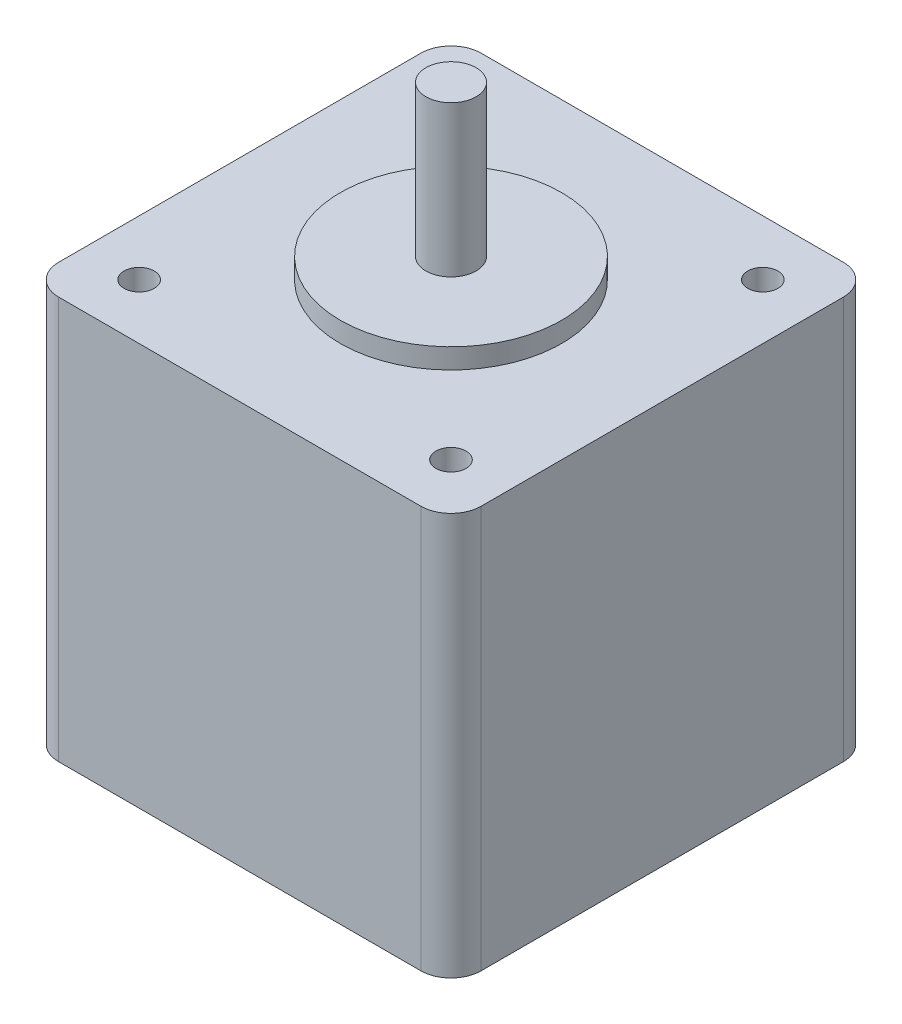
ISO-10303-21;
HEADER;
FILE_DESCRIPTION(('STEP AP214'),'2;1');
FILE_NAME('part.step','',(''),(''),'','','');
FILE_SCHEMA(('AUTOMOTIVE_DESIGN { 1 0 10303 214 1 1 1 1 }'));
ENDSEC;
DATA;
#1=APPLICATION_CONTEXT('core data for automotive mechanical design processes');
#2=APPLICATION_PROTOCOL_DEFINITION('international standard','automotive_design',2000,#1);
#3=PRODUCT_CONTEXT('',#1,'mechanical');
#4=PRODUCT('Part','Part','',(#3));
#5=PRODUCT_RELATED_PRODUCT_CATEGORY('part','',(#4));
#6=PRODUCT_DEFINITION_FORMATION('','',#4);
#7=PRODUCT_DEFINITION_CONTEXT('part definition',#1,'design');
#8=PRODUCT_DEFINITION('design','',#6,#7);
#9=PRODUCT_DEFINITION_SHAPE('','',#8);
#10=(LENGTH_UNIT() NAMED_UNIT(*) SI_UNIT(.MILLI.,.METRE.));
#11=(NAMED_UNIT(*) PLANE_ANGLE_UNIT() SI_UNIT($,.RADIAN.));
#12=(NAMED_UNIT(*) SI_UNIT($,.STERADIAN.) SOLID_ANGLE_UNIT());
#13=UNCERTAINTY_MEASURE_WITH_UNIT(LENGTH_MEASURE(1.E-05),#10,'distance_accuracy_value','');
#14=(GEOMETRIC_REPRESENTATION_CONTEXT(3) GLOBAL_UNCERTAINTY_ASSIGNED_CONTEXT((#13)) GLOBAL_UNIT_ASSIGNED_CONTEXT((#10,
#11,#12)) REPRESENTATION_CONTEXT('',''));
#15=CARTESIAN_POINT('',(0.,0.,0.));
#16=DIRECTION('',(0.,0.,1.));
#17=DIRECTION('',(1.,0.,0.));
#18=AXIS2_PLACEMENT_3D('',#15,#16,#17);
#19=CARTESIAN_POINT('',(21.,42.,-21.));
#20=DIRECTION('',(0.,1.,0.));
#21=DIRECTION('',(0.,0.,1.));
#22=AXIS2_PLACEMENT_3D('',#19,#20,#21);
#23=PLANE('',#22);
#24=CARTESIAN_POINT('',(21.,42.,-21.));
#25=DIRECTION('',(0.,1.,0.));
#26=DIRECTION('',(0.,0.,1.));
#27=AXIS2_PLACEMENT_3D('',#24,#25,#26);
#28=CIRCLE('',#27,11.);
#29=CARTESIAN_POINT('',(21.,42.,-9.99999999999999));
#30=VERTEX_POINT('',#29);
#31=EDGE_CURVE('E136',#30,#30,#28,.T.);
#32=ORIENTED_EDGE('',*,*,#31,.T.);
#33=EDGE_LOOP('',(#32));
#34=FACE_BOUND('',#33,.T.);
#35=CARTESIAN_POINT('',(21.,42.,-21.));
#36=DIRECTION('',(0.,1.,0.));
#37=DIRECTION('',(0.,0.,1.));
#38=AXIS2_PLACEMENT_3D('',#35,#36,#37);
#39=CIRCLE('',#38,2.5);
#40=CARTESIAN_POINT('',(21.,42.,-18.5));
#41=VERTEX_POINT('',#40);
#42=EDGE_CURVE('E187',#41,#41,#39,.T.);
#43=ORIENTED_EDGE('',*,*,#42,.F.);
#44=EDGE_LOOP('',(#43));
#45=FACE_BOUND('',#44,.T.);
#46=ADVANCED_FACE('F33',(#34,#45),#23,.T.);
#47=CARTESIAN_POINT('',(39.,40.,-39.));
#48=DIRECTION('',(0.,-1.,0.));
#49=DIRECTION('',(0.,0.,-1.));
#50=AXIS2_PLACEMENT_3D('',#47,#48,#49);
#51=PLANE('',#50);
#52=CARTESIAN_POINT('',(5.50000000000032,40.,-5.49999999999999));
#53=DIRECTION('',(0.,1.,0.));
#54=DIRECTION('',(0.,0.,1.));
#55=AXIS2_PLACEMENT_3D('',#52,#53,#54);
#56=CIRCLE('',#55,1.5);
#57=CARTESIAN_POINT('',(5.50000000000032,40.,-3.99999999999999));
#58=VERTEX_POINT('',#57);
#59=EDGE_CURVE('E211',#58,#58,#56,.T.);
#60=ORIENTED_EDGE('',*,*,#59,.F.);
#61=EDGE_LOOP('',(#60));
#62=FACE_BOUND('',#61,.T.);
#63=CARTESIAN_POINT('',(36.5000000000003,40.,-5.49999999999999));
#64=DIRECTION('',(0.,1.,0.));
#65=DIRECTION('',(0.,0.,1.));
#66=AXIS2_PLACEMENT_3D('',#63,#64,#65);
#67=CIRCLE('',#66,1.5);
#68=CARTESIAN_POINT('',(36.5000000000003,40.,-3.99999999999999));
#69=VERTEX_POINT('',#68);
#70=EDGE_CURVE('E205',#69,#69,#67,.T.);
#71=ORIENTED_EDGE('',*,*,#70,.F.);
#72=EDGE_LOOP('',(#71));
#73=FACE_BOUND('',#72,.T.);
#74=CARTESIAN_POINT('',(36.5,40.,-36.5));
#75=DIRECTION('',(0.,1.,0.));
#76=DIRECTION('',(0.,0.,1.));
#77=AXIS2_PLACEMENT_3D('',#74,#75,#76);
#78=CIRCLE('',#77,1.5);
#79=CARTESIAN_POINT('',(36.5,40.,-35.));
#80=VERTEX_POINT('',#79);
#81=EDGE_CURVE('E199',#80,#80,#78,.T.);
#82=ORIENTED_EDGE('',*,*,#81,.F.);
#83=EDGE_LOOP('',(#82));
#84=FACE_BOUND('',#83,.T.);
#85=CARTESIAN_POINT('',(5.5,40.,-36.5));
#86=DIRECTION('',(0.,1.,0.));
#87=DIRECTION('',(0.,0.,1.));
#88=AXIS2_PLACEMENT_3D('',#85,#86,#87);
#89=CIRCLE('',#88,1.5);
#90=CARTESIAN_POINT('',(5.5,40.,-35.));
#91=VERTEX_POINT('',#90);
#92=EDGE_CURVE('E193',#91,#91,#89,.T.);
#93=ORIENTED_EDGE('',*,*,#92,.F.);
#94=EDGE_LOOP('',(#93));
#95=FACE_BOUND('',#94,.T.);
#96=CARTESIAN_POINT('',(39.,40.,-39.));
#97=DIRECTION('',(0.,1.,0.));
#98=DIRECTION('',(0.,0.,-1.));
#99=AXIS2_PLACEMENT_3D('',#96,#97,#98);
#100=CIRCLE('',#99,3.);
#101=CARTESIAN_POINT('',(42.,40.,-39.));
#102=VERTEX_POINT('',#101);
#103=CARTESIAN_POINT('',(39.,40.,-42.));
#104=VERTEX_POINT('',#103);
#105=EDGE_CURVE('E147',#102,#104,#100,.T.);
#106=ORIENTED_EDGE('',*,*,#105,.T.);
#107=DIRECTION('',(-1.,0.,0.));
#108=VECTOR('',#107,1.);
#109=CARTESIAN_POINT('',(3.00000000000002,40.,-42.));
#110=LINE('',#109,#108);
#111=CARTESIAN_POINT('',(3.00000000000002,40.,-42.));
#112=VERTEX_POINT('',#111);
#113=EDGE_CURVE('E94',#104,#112,#110,.T.);
#114=ORIENTED_EDGE('',*,*,#113,.T.);
#115=CARTESIAN_POINT('',(3.,40.,-39.));
#116=DIRECTION('',(0.,1.,0.));
#117=DIRECTION('',(0.,0.,-1.));
#118=AXIS2_PLACEMENT_3D('',#115,#116,#117);
#119=CIRCLE('',#118,3.);
#120=CARTESIAN_POINT('',(0.,40.,-39.));
#121=VERTEX_POINT('',#120);
#122=EDGE_CURVE('E178',#112,#121,#119,.T.);
#123=ORIENTED_EDGE('',*,*,#122,.T.);
#124=DIRECTION('',(0.,0.,1.));
#125=VECTOR('',#124,1.);
#126=CARTESIAN_POINT('',(0.,40.,-3.00000000000002));
#127=LINE('',#126,#125);
#128=CARTESIAN_POINT('',(0.,40.,-3.00000000000002));
#129=VERTEX_POINT('',#128);
#130=EDGE_CURVE('E177',#121,#129,#127,.T.);
#131=ORIENTED_EDGE('',*,*,#130,.T.);
#132=CARTESIAN_POINT('',(3.,40.,-3.));
#133=DIRECTION('',(0.,1.,0.));
#134=DIRECTION('',(0.,0.,-1.));
#135=AXIS2_PLACEMENT_3D('',#132,#133,#134);
#136=CIRCLE('',#135,3.);
#137=CARTESIAN_POINT('',(3.00000000000002,40.,0.));
#138=VERTEX_POINT('',#137);
#139=EDGE_CURVE('E114',#129,#138,#136,.T.);
#140=ORIENTED_EDGE('',*,*,#139,.T.);
#141=DIRECTION('',(1.,0.,0.));
#142=VECTOR('',#141,1.);
#143=CARTESIAN_POINT('',(3.00000000000002,40.,0.));
#144=LINE('',#143,#142);
#145=CARTESIAN_POINT('',(39.,40.,0.));
#146=VERTEX_POINT('',#145);
#147=EDGE_CURVE('E107',#138,#146,#144,.T.);
#148=ORIENTED_EDGE('',*,*,#147,.T.);
#149=CARTESIAN_POINT('',(39.,40.,-3.));
#150=DIRECTION('',(0.,1.,0.));
#151=DIRECTION('',(0.,0.,1.));
#152=AXIS2_PLACEMENT_3D('',#149,#150,#151);
#153=CIRCLE('',#152,3.);
#154=CARTESIAN_POINT('',(42.,40.,-3.00000000000002));
#155=VERTEX_POINT('',#154);
#156=EDGE_CURVE('E112',#146,#155,#153,.T.);
#157=ORIENTED_EDGE('',*,*,#156,.T.);
#158=DIRECTION('',(0.,0.,-1.));
#159=VECTOR('',#158,1.);
#160=CARTESIAN_POINT('',(42.,40.,-3.00000000000002));
#161=LINE('',#160,#159);
#162=EDGE_CURVE('E50',#155,#102,#161,.T.);
#163=ORIENTED_EDGE('',*,*,#162,.T.);
#164=EDGE_LOOP('',(#106,#114,#123,#131,#140,#148,#157,#163));
#165=FACE_BOUND('',#164,.T.);
#166=CARTESIAN_POINT('',(21.,40.,-21.));
#167=DIRECTION('',(0.,-1.,0.));
#168=DIRECTION('',(0.,0.,-1.));
#169=AXIS2_PLACEMENT_3D('',#166,#167,#168);
#170=CIRCLE('',#169,11.);
#171=CARTESIAN_POINT('',(21.,40.,-32.));
#172=VERTEX_POINT('',#171);
#173=EDGE_CURVE('E11',#172,#172,#170,.F.);
#174=ORIENTED_EDGE('',*,*,#173,.F.);
#175=EDGE_LOOP('',(#174));
#176=FACE_BOUND('',#175,.T.);
#177=ADVANCED_FACE('F109',(#62,#73,#84,#95,#165,#176),#51,.F.);
#178=CARTESIAN_POINT('',(39.,40.,-39.));
#179=DIRECTION('',(0.,-1.,0.));
#180=DIRECTION('',(0.,0.,-1.));
#181=AXIS2_PLACEMENT_3D('',#178,#179,#180);
#182=CYLINDRICAL_SURFACE('',#181,3.);
#183=CARTESIAN_POINT('',(39.,0.,-39.));
#184=DIRECTION('',(0.,1.,0.));
#185=DIRECTION('',(0.,0.,-1.));
#186=AXIS2_PLACEMENT_3D('',#183,#184,#185);
#187=CIRCLE('',#186,3.);
#188=CARTESIAN_POINT('',(42.,0.,-39.));
#189=VERTEX_POINT('',#188);
#190=CARTESIAN_POINT('',(39.,0.,-42.));
#191=VERTEX_POINT('',#190);
#192=EDGE_CURVE('E132',#189,#191,#187,.T.);
#193=ORIENTED_EDGE('',*,*,#192,.T.);
#194=DIRECTION('',(0.,-1.,0.));
#195=VECTOR('',#194,1.);
#196=CARTESIAN_POINT('',(39.,40.,-42.));
#197=LINE('',#196,#195);
#198=EDGE_CURVE('E42',#104,#191,#197,.T.);
#199=ORIENTED_EDGE('',*,*,#198,.F.);
#200=ORIENTED_EDGE('',*,*,#105,.F.);
#201=DIRECTION('',(0.,-1.,0.));
#202=VECTOR('',#201,1.);
#203=CARTESIAN_POINT('',(42.,40.,-39.));
#204=LINE('',#203,#202);
#205=EDGE_CURVE('E128',#102,#189,#204,.T.);
#206=ORIENTED_EDGE('',*,*,#205,.T.);
#207=EDGE_LOOP('',(#193,#199,#200,#206));
#208=FACE_BOUND('',#207,.T.);
#209=ADVANCED_FACE('F35',(#208),#182,.T.);
#210=CARTESIAN_POINT('',(3.00000000000002,40.,-42.));
#211=DIRECTION('',(0.,0.,1.));
#212=DIRECTION('',(1.,0.,0.));
#213=AXIS2_PLACEMENT_3D('',#210,#211,#212);
#214=PLANE('',#213);
#215=DIRECTION('',(-1.,0.,0.));
#216=VECTOR('',#215,1.);
#217=CARTESIAN_POINT('',(3.00000000000002,0.,-42.));
#218=LINE('',#217,#216);
#219=CARTESIAN_POINT('',(3.00000000000002,0.,-42.));
#220=VERTEX_POINT('',#219);
#221=EDGE_CURVE('E135',#191,#220,#218,.T.);
#222=ORIENTED_EDGE('',*,*,#221,.T.);
#223=DIRECTION('',(0.,-1.,0.));
#224=VECTOR('',#223,1.);
#225=CARTESIAN_POINT('',(3.00000000000002,40.,-42.));
#226=LINE('',#225,#224);
#227=EDGE_CURVE('E157',#112,#220,#226,.T.);
#228=ORIENTED_EDGE('',*,*,#227,.F.);
#229=ORIENTED_EDGE('',*,*,#113,.F.);
#230=ORIENTED_EDGE('',*,*,#198,.T.);
#231=EDGE_LOOP('',(#222,#228,#229,#230));
#232=FACE_BOUND('',#231,.T.);
#233=ADVANCED_FACE('F160',(#232),#214,.F.);
#234=CARTESIAN_POINT('',(3.,40.,-39.));
#235=DIRECTION('',(0.,-1.,0.));
#236=DIRECTION('',(0.,0.,-1.));
#237=AXIS2_PLACEMENT_3D('',#234,#235,#236);
#238=CYLINDRICAL_SURFACE('',#237,3.);
#239=CARTESIAN_POINT('',(3.,0.,-39.));
#240=DIRECTION('',(0.,1.,0.));
#241=DIRECTION('',(0.,0.,-1.));
#242=AXIS2_PLACEMENT_3D('',#239,#240,#241);
#243=CIRCLE('',#242,3.);
#244=CARTESIAN_POINT('',(0.,0.,-39.));
#245=VERTEX_POINT('',#244);
#246=EDGE_CURVE('E138',#220,#245,#243,.T.);
#247=ORIENTED_EDGE('',*,*,#246,.T.);
#248=DIRECTION('',(0.,-1.,0.));
#249=VECTOR('',#248,1.);
#250=CARTESIAN_POINT('',(0.,40.,-39.));
#251=LINE('',#250,#249);
#252=EDGE_CURVE('E154',#121,#245,#251,.T.);
#253=ORIENTED_EDGE('',*,*,#252,.F.);
#254=ORIENTED_EDGE('',*,*,#122,.F.);
#255=ORIENTED_EDGE('',*,*,#227,.T.);
#256=EDGE_LOOP('',(#247,#253,#254,#255));
#257=FACE_BOUND('',#256,.T.);
#258=ADVANCED_FACE('F171',(#257),#238,.T.);
#259=CARTESIAN_POINT('',(0.,40.,-3.00000000000002));
#260=DIRECTION('',(1.,0.,0.));
#261=DIRECTION('',(0.,0.,-1.));
#262=AXIS2_PLACEMENT_3D('',#259,#260,#261);
#263=PLANE('',#262);
#264=DIRECTION('',(0.,0.,1.));
#265=VECTOR('',#264,1.);
#266=CARTESIAN_POINT('',(0.,0.,-3.00000000000002));
#267=LINE('',#266,#265);
#268=CARTESIAN_POINT('',(0.,0.,-3.00000000000002));
#269=VERTEX_POINT('',#268);
#270=EDGE_CURVE('E140',#245,#269,#267,.T.);
#271=ORIENTED_EDGE('',*,*,#270,.T.);
#272=DIRECTION('',(0.,-1.,0.));
#273=VECTOR('',#272,1.);
#274=CARTESIAN_POINT('',(0.,40.,-3.00000000000002));
#275=LINE('',#274,#273);
#276=EDGE_CURVE('E151',#129,#269,#275,.T.);
#277=ORIENTED_EDGE('',*,*,#276,.F.);
#278=ORIENTED_EDGE('',*,*,#130,.F.);
#279=ORIENTED_EDGE('',*,*,#252,.T.);
#280=EDGE_LOOP('',(#271,#277,#278,#279));
#281=FACE_BOUND('',#280,.T.);
#282=ADVANCED_FACE('F175',(#281),#263,.F.);
#283=CARTESIAN_POINT('',(3.,40.,-3.));
#284=DIRECTION('',(0.,-1.,0.));
#285=DIRECTION('',(0.,0.,-1.));
#286=AXIS2_PLACEMENT_3D('',#283,#284,#285);
#287=CYLINDRICAL_SURFACE('',#286,3.);
#288=CARTESIAN_POINT('',(3.,0.,-3.));
#289=DIRECTION('',(0.,1.,0.));
#290=DIRECTION('',(0.,0.,-1.));
#291=AXIS2_PLACEMENT_3D('',#288,#289,#290);
#292=CIRCLE('',#291,3.);
#293=CARTESIAN_POINT('',(3.00000000000002,0.,0.));
#294=VERTEX_POINT('',#293);
#295=EDGE_CURVE('E142',#269,#294,#292,.T.);
#296=ORIENTED_EDGE('',*,*,#295,.T.);
#297=DIRECTION('',(0.,-1.,0.));
#298=VECTOR('',#297,1.);
#299=CARTESIAN_POINT('',(3.00000000000002,40.,0.));
#300=LINE('',#299,#298);
#301=EDGE_CURVE('E123',#138,#294,#300,.T.);
#302=ORIENTED_EDGE('',*,*,#301,.F.);
#303=ORIENTED_EDGE('',*,*,#139,.F.);
#304=ORIENTED_EDGE('',*,*,#276,.T.);
#305=EDGE_LOOP('',(#296,#302,#303,#304));
#306=FACE_BOUND('',#305,.T.);
#307=ADVANCED_FACE('F273',(#306),#287,.T.);
#308=CARTESIAN_POINT('',(3.00000000000002,40.,0.));
#309=DIRECTION('',(0.,0.,-1.));
#310=DIRECTION('',(-1.,0.,0.));
#311=AXIS2_PLACEMENT_3D('',#308,#309,#310);
#312=PLANE('',#311);
#313=DIRECTION('',(1.,0.,0.));
#314=VECTOR('',#313,1.);
#315=CARTESIAN_POINT('',(3.00000000000002,0.,0.));
#316=LINE('',#315,#314);
#317=CARTESIAN_POINT('',(39.,0.,0.));
#318=VERTEX_POINT('',#317);
#319=EDGE_CURVE('E122',#294,#318,#316,.T.);
#320=ORIENTED_EDGE('',*,*,#319,.T.);
#321=DIRECTION('',(0.,-1.,0.));
#322=VECTOR('',#321,1.);
#323=CARTESIAN_POINT('',(39.,40.,0.));
#324=LINE('',#323,#322);
#325=EDGE_CURVE('E119',#146,#318,#324,.T.);
#326=ORIENTED_EDGE('',*,*,#325,.F.);
#327=ORIENTED_EDGE('',*,*,#147,.F.);
#328=ORIENTED_EDGE('',*,*,#301,.T.);
#329=EDGE_LOOP('',(#320,#326,#327,#328));
#330=FACE_BOUND('',#329,.T.);
#331=ADVANCED_FACE('F120',(#330),#312,.F.);
#332=CARTESIAN_POINT('',(39.,40.,-3.));
#333=DIRECTION('',(0.,-1.,0.));
#334=DIRECTION('',(0.,0.,-1.));
#335=AXIS2_PLACEMENT_3D('',#332,#333,#334);
#336=CYLINDRICAL_SURFACE('',#335,3.);
#337=CARTESIAN_POINT('',(39.,0.,-3.));
#338=DIRECTION('',(0.,1.,0.));
#339=DIRECTION('',(0.,0.,1.));
#340=AXIS2_PLACEMENT_3D('',#337,#338,#339);
#341=CIRCLE('',#340,3.);
#342=CARTESIAN_POINT('',(42.,0.,-3.00000000000002));
#343=VERTEX_POINT('',#342);
#344=EDGE_CURVE('E79',#318,#343,#341,.T.);
#345=ORIENTED_EDGE('',*,*,#344,.T.);
#346=DIRECTION('',(0.,-1.,0.));
#347=VECTOR('',#346,1.);
#348=CARTESIAN_POINT('',(42.,40.,-3.00000000000002));
#349=LINE('',#348,#347);
#350=EDGE_CURVE('E124',#155,#343,#349,.T.);
#351=ORIENTED_EDGE('',*,*,#350,.F.);
#352=ORIENTED_EDGE('',*,*,#156,.F.);
#353=ORIENTED_EDGE('',*,*,#325,.T.);
#354=EDGE_LOOP('',(#345,#351,#352,#353));
#355=FACE_BOUND('',#354,.T.);
#356=ADVANCED_FACE('F126',(#355),#336,.T.);
#357=CARTESIAN_POINT('',(42.,40.,-3.00000000000002));
#358=DIRECTION('',(-1.,0.,0.));
#359=DIRECTION('',(0.,0.,1.));
#360=AXIS2_PLACEMENT_3D('',#357,#358,#359);
#361=PLANE('',#360);
#362=DIRECTION('',(0.,0.,-1.));
#363=VECTOR('',#362,1.);
#364=CARTESIAN_POINT('',(42.,0.,-3.00000000000002));
#365=LINE('',#364,#363);
#366=EDGE_CURVE('E85',#343,#189,#365,.T.);
#367=ORIENTED_EDGE('',*,*,#366,.T.);
#368=ORIENTED_EDGE('',*,*,#205,.F.);
#369=ORIENTED_EDGE('',*,*,#162,.F.);
#370=ORIENTED_EDGE('',*,*,#350,.T.);
#371=EDGE_LOOP('',(#367,#368,#369,#370));
#372=FACE_BOUND('',#371,.T.);
#373=ADVANCED_FACE('F266',(#372),#361,.F.);
#374=CARTESIAN_POINT('',(39.,0.,-39.));
#375=DIRECTION('',(0.,-1.,0.));
#376=DIRECTION('',(0.,0.,-1.));
#377=AXIS2_PLACEMENT_3D('',#374,#375,#376);
#378=PLANE('',#377);
#379=ORIENTED_EDGE('',*,*,#192,.F.);
#380=ORIENTED_EDGE('',*,*,#366,.F.);
#381=ORIENTED_EDGE('',*,*,#344,.F.);
#382=ORIENTED_EDGE('',*,*,#319,.F.);
#383=ORIENTED_EDGE('',*,*,#295,.F.);
#384=ORIENTED_EDGE('',*,*,#270,.F.);
#385=ORIENTED_EDGE('',*,*,#246,.F.);
#386=ORIENTED_EDGE('',*,*,#221,.F.);
#387=EDGE_LOOP('',(#379,#380,#381,#382,#383,#384,#385,#386));
#388=FACE_BOUND('',#387,.T.);
#389=ADVANCED_FACE('F165',(#388),#378,.T.);
#390=CARTESIAN_POINT('',(21.,42.,-21.));
#391=DIRECTION('',(0.,-1.,0.));
#392=DIRECTION('',(0.,0.,-1.));
#393=AXIS2_PLACEMENT_3D('',#390,#391,#392);
#394=CYLINDRICAL_SURFACE('',#393,11.);
#395=ORIENTED_EDGE('',*,*,#31,.F.);
#396=EDGE_LOOP('',(#395));
#397=FACE_BOUND('',#396,.T.);
#398=ORIENTED_EDGE('',*,*,#173,.T.);
#399=EDGE_LOOP('',(#398));
#400=FACE_BOUND('',#399,.T.);
#401=ADVANCED_FACE('F260',(#397,#400),#394,.T.);
#402=CARTESIAN_POINT('',(21.,57.,-21.));
#403=DIRECTION('',(0.,-1.,0.));
#404=DIRECTION('',(0.,0.,-1.));
#405=AXIS2_PLACEMENT_3D('',#402,#403,#404);
#406=CYLINDRICAL_SURFACE('',#405,2.5);
#407=CARTESIAN_POINT('',(21.,57.,-21.));
#408=DIRECTION('',(0.,1.,0.));
#409=DIRECTION('',(0.,0.,1.));
#410=AXIS2_PLACEMENT_3D('',#407,#408,#409);
#411=CIRCLE('',#410,2.5);
#412=CARTESIAN_POINT('',(21.,57.,-18.5));
#413=VERTEX_POINT('',#412);
#414=EDGE_CURVE('E186',#413,#413,#411,.T.);
#415=ORIENTED_EDGE('',*,*,#414,.F.);
#416=EDGE_LOOP('',(#415));
#417=FACE_BOUND('',#416,.T.);
#418=ORIENTED_EDGE('',*,*,#42,.T.);
#419=EDGE_LOOP('',(#418));
#420=FACE_BOUND('',#419,.T.);
#421=ADVANCED_FACE('F248',(#417,#420),#406,.T.);
#422=CARTESIAN_POINT('',(21.,57.,-21.));
#423=DIRECTION('',(0.,1.,0.));
#424=DIRECTION('',(0.,0.,1.));
#425=AXIS2_PLACEMENT_3D('',#422,#423,#424);
#426=PLANE('',#425);
#427=ORIENTED_EDGE('',*,*,#414,.T.);
#428=EDGE_LOOP('',(#427));
#429=FACE_BOUND('',#428,.T.);
#430=ADVANCED_FACE('F238',(#429),#426,.T.);
#431=CARTESIAN_POINT('',(5.5,35.,-36.5));
#432=DIRECTION('',(0.,1.,0.));
#433=DIRECTION('',(0.,0.,1.));
#434=AXIS2_PLACEMENT_3D('',#431,#432,#433);
#435=CYLINDRICAL_SURFACE('',#434,1.5);
#436=CARTESIAN_POINT('',(5.5,35.,-36.5));
#437=DIRECTION('',(0.,1.,0.));
#438=DIRECTION('',(0.,0.,1.));
#439=AXIS2_PLACEMENT_3D('',#436,#437,#438);
#440=CIRCLE('',#439,1.5);
#441=CARTESIAN_POINT('',(5.5,35.,-35.));
#442=VERTEX_POINT('',#441);
#443=EDGE_CURVE('E190',#442,#442,#440,.T.);
#444=ORIENTED_EDGE('',*,*,#443,.F.);
#445=EDGE_LOOP('',(#444));
#446=FACE_BOUND('',#445,.T.);
#447=ORIENTED_EDGE('',*,*,#92,.T.);
#448=EDGE_LOOP('',(#447));
#449=FACE_BOUND('',#448,.T.);
#450=ADVANCED_FACE('F235',(#446,#449),#435,.F.);
#451=CARTESIAN_POINT('',(5.5,35.,-36.5));
#452=DIRECTION('',(0.,1.,0.));
#453=DIRECTION('',(0.,0.,1.));
#454=AXIS2_PLACEMENT_3D('',#451,#452,#453);
#455=PLANE('',#454);
#456=ORIENTED_EDGE('',*,*,#443,.T.);
#457=EDGE_LOOP('',(#456));
#458=FACE_BOUND('',#457,.T.);
#459=ADVANCED_FACE('F237',(#458),#455,.T.);
#460=CARTESIAN_POINT('',(36.5,35.,-36.5));
#461=DIRECTION('',(0.,1.,0.));
#462=DIRECTION('',(0.,0.,1.));
#463=AXIS2_PLACEMENT_3D('',#460,#461,#462);
#464=CYLINDRICAL_SURFACE('',#463,1.5);
#465=CARTESIAN_POINT('',(36.5,35.,-36.5));
#466=DIRECTION('',(0.,1.,0.));
#467=DIRECTION('',(0.,0.,1.));
#468=AXIS2_PLACEMENT_3D('',#465,#466,#467);
#469=CIRCLE('',#468,1.5);
#470=CARTESIAN_POINT('',(36.5,35.,-35.));
#471=VERTEX_POINT('',#470);
#472=EDGE_CURVE('E196',#471,#471,#469,.T.);
#473=ORIENTED_EDGE('',*,*,#472,.F.);
#474=EDGE_LOOP('',(#473));
#475=FACE_BOUND('',#474,.T.);
#476=ORIENTED_EDGE('',*,*,#81,.T.);
#477=EDGE_LOOP('',(#476));
#478=FACE_BOUND('',#477,.T.);
#479=ADVANCED_FACE('F245',(#475,#478),#464,.F.);
#480=CARTESIAN_POINT('',(36.5,35.,-36.5));
#481=DIRECTION('',(0.,1.,0.));
#482=DIRECTION('',(0.,0.,1.));
#483=AXIS2_PLACEMENT_3D('',#480,#481,#482);
#484=PLANE('',#483);
#485=ORIENTED_EDGE('',*,*,#472,.T.);
#486=EDGE_LOOP('',(#485));
#487=FACE_BOUND('',#486,.T.);
#488=ADVANCED_FACE('F315',(#487),#484,.T.);
#489=CARTESIAN_POINT('',(36.5000000000003,35.,-5.49999999999999));
#490=DIRECTION('',(0.,1.,0.));
#491=DIRECTION('',(0.,0.,1.));
#492=AXIS2_PLACEMENT_3D('',#489,#490,#491);
#493=CYLINDRICAL_SURFACE('',#492,1.5);
#494=CARTESIAN_POINT('',(36.5000000000003,35.,-5.49999999999999));
#495=DIRECTION('',(0.,1.,0.));
#496=DIRECTION('',(0.,0.,1.));
#497=AXIS2_PLACEMENT_3D('',#494,#495,#496);
#498=CIRCLE('',#497,1.5);
#499=CARTESIAN_POINT('',(36.5000000000003,35.,-3.99999999999999));
#500=VERTEX_POINT('',#499);
#501=EDGE_CURVE('E202',#500,#500,#498,.T.);
#502=ORIENTED_EDGE('',*,*,#501,.F.);
#503=EDGE_LOOP('',(#502));
#504=FACE_BOUND('',#503,.T.);
#505=ORIENTED_EDGE('',*,*,#70,.T.);
#506=EDGE_LOOP('',(#505));
#507=FACE_BOUND('',#506,.T.);
#508=ADVANCED_FACE('F325',(#504,#507),#493,.F.);
#509=CARTESIAN_POINT('',(36.5000000000003,35.,-5.49999999999999));
#510=DIRECTION('',(0.,1.,0.));
#511=DIRECTION('',(0.,0.,1.));
#512=AXIS2_PLACEMENT_3D('',#509,#510,#511);
#513=PLANE('',#512);
#514=ORIENTED_EDGE('',*,*,#501,.T.);
#515=EDGE_LOOP('',(#514));
#516=FACE_BOUND('',#515,.T.);
#517=ADVANCED_FACE('F222',(#516),#513,.T.);
#518=CARTESIAN_POINT('',(5.50000000000032,35.,-5.49999999999999));
#519=DIRECTION('',(0.,1.,0.));
#520=DIRECTION('',(0.,0.,1.));
#521=AXIS2_PLACEMENT_3D('',#518,#519,#520);
#522=CYLINDRICAL_SURFACE('',#521,1.5);
#523=CARTESIAN_POINT('',(5.50000000000032,35.,-5.49999999999999));
#524=DIRECTION('',(0.,1.,0.));
#525=DIRECTION('',(0.,0.,1.));
#526=AXIS2_PLACEMENT_3D('',#523,#524,#525);
#527=CIRCLE('',#526,1.5);
#528=CARTESIAN_POINT('',(5.50000000000032,35.,-3.99999999999999));
#529=VERTEX_POINT('',#528);
#530=EDGE_CURVE('E208',#529,#529,#527,.T.);
#531=ORIENTED_EDGE('',*,*,#530,.F.);
#532=EDGE_LOOP('',(#531));
#533=FACE_BOUND('',#532,.T.);
#534=ORIENTED_EDGE('',*,*,#59,.T.);
#535=EDGE_LOOP('',(#534));
#536=FACE_BOUND('',#535,.T.);
#537=ADVANCED_FACE('F219',(#533,#536),#522,.F.);
#538=CARTESIAN_POINT('',(5.50000000000032,35.,-5.49999999999999));
#539=DIRECTION('',(0.,1.,0.));
#540=DIRECTION('',(0.,0.,1.));
#541=AXIS2_PLACEMENT_3D('',#538,#539,#540);
#542=PLANE('',#541);
#543=ORIENTED_EDGE('',*,*,#530,.T.);
#544=EDGE_LOOP('',(#543));
#545=FACE_BOUND('',#544,.T.);
#546=ADVANCED_FACE('F217',(#545),#542,.T.);
#547=CLOSED_SHELL('',(#46,#177,#209,#233,#258,#282,#307,#331,#356,#373,#389,#401,#421,#430,#450,
#459,#479,#488,#508,#517,#537,#546));
#548=MANIFOLD_SOLID_BREP('B2',#547);
#549=ADVANCED_BREP_SHAPE_REPRESENTATION('',(#18,#548),#14);
#550=SHAPE_DEFINITION_REPRESENTATION(#9,#549);
ENDSEC;
END-ISO-10303-21;
